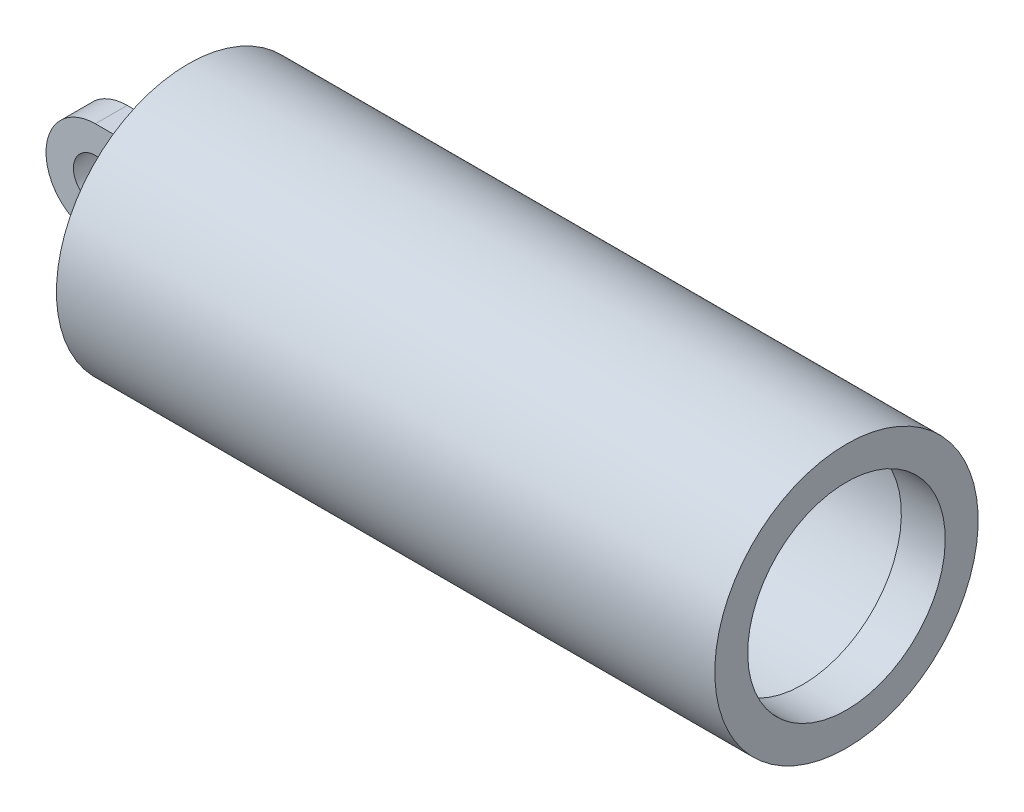
ISO-10303-21;
HEADER;
FILE_DESCRIPTION(('STEP AP214'),'2;1');
FILE_NAME('part.step','',(''),(''),'','','');
FILE_SCHEMA(('AUTOMOTIVE_DESIGN { 1 0 10303 214 1 1 1 1 }'));
ENDSEC;
DATA;
#1=APPLICATION_CONTEXT('core data for automotive mechanical design processes');
#2=APPLICATION_PROTOCOL_DEFINITION('international standard','automotive_design',2000,#1);
#3=PRODUCT_CONTEXT('',#1,'mechanical');
#4=PRODUCT('Part','Part','',(#3));
#5=PRODUCT_RELATED_PRODUCT_CATEGORY('part','',(#4));
#6=PRODUCT_DEFINITION_FORMATION('','',#4);
#7=PRODUCT_DEFINITION_CONTEXT('part definition',#1,'design');
#8=PRODUCT_DEFINITION('design','',#6,#7);
#9=PRODUCT_DEFINITION_SHAPE('','',#8);
#10=(LENGTH_UNIT() NAMED_UNIT(*) SI_UNIT(.MILLI.,.METRE.));
#11=(NAMED_UNIT(*) PLANE_ANGLE_UNIT() SI_UNIT($,.RADIAN.));
#12=(NAMED_UNIT(*) SI_UNIT($,.STERADIAN.) SOLID_ANGLE_UNIT());
#13=UNCERTAINTY_MEASURE_WITH_UNIT(LENGTH_MEASURE(1.E-05),#10,'distance_accuracy_value','');
#14=(GEOMETRIC_REPRESENTATION_CONTEXT(3) GLOBAL_UNCERTAINTY_ASSIGNED_CONTEXT((#13)) GLOBAL_UNIT_ASSIGNED_CONTEXT((#10,
#11,#12)) REPRESENTATION_CONTEXT('',''));
#15=CARTESIAN_POINT('',(0.,0.,0.));
#16=DIRECTION('',(0.,0.,1.));
#17=DIRECTION('',(1.,0.,0.));
#18=AXIS2_PLACEMENT_3D('',#15,#16,#17);
#19=CARTESIAN_POINT('',(-150.,0.,0.));
#20=DIRECTION('',(-1.,0.,0.));
#21=DIRECTION('',(0.,-1.,0.));
#22=AXIS2_PLACEMENT_3D('',#19,#20,#21);
#23=CYLINDRICAL_SURFACE('',#22,55.);
#24=CARTESIAN_POINT('',(130.,0.,0.));
#25=DIRECTION('',(-1.,0.,0.));
#26=DIRECTION('',(0.,-1.,0.));
#27=AXIS2_PLACEMENT_3D('',#24,#25,#26);
#28=CIRCLE('',#27,55.);
#29=CARTESIAN_POINT('',(130.,-55.,0.));
#30=VERTEX_POINT('',#29);
#31=EDGE_CURVE('E115',#30,#30,#28,.T.);
#32=ORIENTED_EDGE('',*,*,#31,.F.);
#33=EDGE_LOOP('',(#32));
#34=FACE_BOUND('',#33,.T.);
#35=CARTESIAN_POINT('',(-130.,0.,0.));
#36=DIRECTION('',(-1.,0.,0.));
#37=DIRECTION('',(0.,-1.,0.));
#38=AXIS2_PLACEMENT_3D('',#35,#36,#37);
#39=CIRCLE('',#38,55.);
#40=CARTESIAN_POINT('',(-130.,-55.,0.));
#41=VERTEX_POINT('',#40);
#42=EDGE_CURVE('E11',#41,#41,#39,.T.);
#43=ORIENTED_EDGE('',*,*,#42,.T.);
#44=EDGE_LOOP('',(#43));
#45=FACE_BOUND('',#44,.T.);
#46=ADVANCED_FACE('F34',(#34,#45),#23,.F.);
#47=CARTESIAN_POINT('',(-130.,0.,0.));
#48=DIRECTION('',(-1.,0.,0.));
#49=DIRECTION('',(0.,-1.,0.));
#50=AXIS2_PLACEMENT_3D('',#47,#48,#49);
#51=PLANE('',#50);
#52=ORIENTED_EDGE('',*,*,#42,.F.);
#53=EDGE_LOOP('',(#52));
#54=FACE_BOUND('',#53,.T.);
#55=ADVANCED_FACE('F160',(#54),#51,.F.);
#56=CARTESIAN_POINT('',(-150.,60.,0.));
#57=DIRECTION('',(1.,0.,0.));
#58=DIRECTION('',(0.,1.,0.));
#59=AXIS2_PLACEMENT_3D('',#56,#57,#58);
#60=PLANE('',#59);
#61=DIRECTION('',(0.,1.,0.));
#62=VECTOR('',#61,1.);
#63=CARTESIAN_POINT('',(-150.,22.5,-7.25));
#64=LINE('',#63,#62);
#65=CARTESIAN_POINT('',(-150.,-22.5,-7.25));
#66=VERTEX_POINT('',#65);
#67=CARTESIAN_POINT('',(-150.,22.5,-7.25));
#68=VERTEX_POINT('',#67);
#69=EDGE_CURVE('E83',#66,#68,#64,.T.);
#70=ORIENTED_EDGE('',*,*,#69,.T.);
#71=DIRECTION('',(0.,0.,1.));
#72=VECTOR('',#71,1.);
#73=CARTESIAN_POINT('',(-150.,22.5,-7.25));
#74=LINE('',#73,#72);
#75=CARTESIAN_POINT('',(-150.,22.5,7.25));
#76=VERTEX_POINT('',#75);
#77=EDGE_CURVE('E113',#68,#76,#74,.T.);
#78=ORIENTED_EDGE('',*,*,#77,.T.);
#79=DIRECTION('',(0.,1.,0.));
#80=VECTOR('',#79,1.);
#81=CARTESIAN_POINT('',(-150.,22.5,7.25));
#82=LINE('',#81,#80);
#83=CARTESIAN_POINT('',(-150.,-22.5,7.25));
#84=VERTEX_POINT('',#83);
#85=EDGE_CURVE('E96',#84,#76,#82,.T.);
#86=ORIENTED_EDGE('',*,*,#85,.F.);
#87=DIRECTION('',(0.,0.,1.));
#88=VECTOR('',#87,1.);
#89=CARTESIAN_POINT('',(-150.,-22.5,-7.25));
#90=LINE('',#89,#88);
#91=EDGE_CURVE('E116',#66,#84,#90,.T.);
#92=ORIENTED_EDGE('',*,*,#91,.F.);
#93=EDGE_LOOP('',(#70,#78,#86,#92));
#94=FACE_BOUND('',#93,.T.);
#95=CARTESIAN_POINT('',(-150.,0.,0.));
#96=DIRECTION('',(-1.,0.,0.));
#97=DIRECTION('',(0.,-1.,0.));
#98=AXIS2_PLACEMENT_3D('',#95,#96,#97);
#99=CIRCLE('',#98,60.);
#100=CARTESIAN_POINT('',(-150.,-60.,0.));
#101=VERTEX_POINT('',#100);
#102=EDGE_CURVE('E41',#101,#101,#99,.T.);
#103=ORIENTED_EDGE('',*,*,#102,.T.);
#104=EDGE_LOOP('',(#103));
#105=FACE_BOUND('',#104,.T.);
#106=ADVANCED_FACE('F132',(#94,#105),#60,.F.);
#107=CARTESIAN_POINT('',(-150.,0.,0.));
#108=DIRECTION('',(-1.,0.,0.));
#109=DIRECTION('',(0.,-1.,0.));
#110=AXIS2_PLACEMENT_3D('',#107,#108,#109);
#111=CYLINDRICAL_SURFACE('',#110,60.);
#112=ORIENTED_EDGE('',*,*,#102,.F.);
#113=EDGE_LOOP('',(#112));
#114=FACE_BOUND('',#113,.T.);
#115=CARTESIAN_POINT('',(150.,0.,0.));
#116=DIRECTION('',(-1.,0.,0.));
#117=DIRECTION('',(0.,-1.,0.));
#118=AXIS2_PLACEMENT_3D('',#115,#116,#117);
#119=CIRCLE('',#118,60.);
#120=CARTESIAN_POINT('',(150.,-60.,0.));
#121=VERTEX_POINT('',#120);
#122=EDGE_CURVE('E127',#121,#121,#119,.T.);
#123=ORIENTED_EDGE('',*,*,#122,.T.);
#124=EDGE_LOOP('',(#123));
#125=FACE_BOUND('',#124,.T.);
#126=ADVANCED_FACE('F134',(#114,#125),#111,.T.);
#127=CARTESIAN_POINT('',(150.,45.,0.));
#128=DIRECTION('',(-1.,0.,0.));
#129=DIRECTION('',(0.,-1.,0.));
#130=AXIS2_PLACEMENT_3D('',#127,#128,#129);
#131=PLANE('',#130);
#132=ORIENTED_EDGE('',*,*,#122,.F.);
#133=EDGE_LOOP('',(#132));
#134=FACE_BOUND('',#133,.T.);
#135=CARTESIAN_POINT('',(150.,0.,0.));
#136=DIRECTION('',(-1.,0.,0.));
#137=DIRECTION('',(0.,-1.,0.));
#138=AXIS2_PLACEMENT_3D('',#135,#136,#137);
#139=CIRCLE('',#138,45.);
#140=CARTESIAN_POINT('',(150.,-45.,0.));
#141=VERTEX_POINT('',#140);
#142=EDGE_CURVE('E124',#141,#141,#139,.T.);
#143=ORIENTED_EDGE('',*,*,#142,.T.);
#144=EDGE_LOOP('',(#143));
#145=FACE_BOUND('',#144,.T.);
#146=ADVANCED_FACE('F137',(#134,#145),#131,.F.);
#147=CARTESIAN_POINT('',(-150.,0.,0.));
#148=DIRECTION('',(-1.,0.,0.));
#149=DIRECTION('',(0.,-1.,0.));
#150=AXIS2_PLACEMENT_3D('',#147,#148,#149);
#151=CYLINDRICAL_SURFACE('',#150,45.);
#152=ORIENTED_EDGE('',*,*,#142,.F.);
#153=EDGE_LOOP('',(#152));
#154=FACE_BOUND('',#153,.T.);
#155=CARTESIAN_POINT('',(130.,0.,0.));
#156=DIRECTION('',(-1.,0.,0.));
#157=DIRECTION('',(0.,-1.,0.));
#158=AXIS2_PLACEMENT_3D('',#155,#156,#157);
#159=CIRCLE('',#158,45.);
#160=CARTESIAN_POINT('',(130.,-45.,0.));
#161=VERTEX_POINT('',#160);
#162=EDGE_CURVE('E121',#161,#161,#159,.T.);
#163=ORIENTED_EDGE('',*,*,#162,.T.);
#164=EDGE_LOOP('',(#163));
#165=FACE_BOUND('',#164,.T.);
#166=ADVANCED_FACE('F143',(#154,#165),#151,.F.);
#167=CARTESIAN_POINT('',(130.,55.,0.));
#168=DIRECTION('',(1.,0.,0.));
#169=DIRECTION('',(0.,1.,0.));
#170=AXIS2_PLACEMENT_3D('',#167,#168,#169);
#171=PLANE('',#170);
#172=ORIENTED_EDGE('',*,*,#162,.F.);
#173=EDGE_LOOP('',(#172));
#174=FACE_BOUND('',#173,.T.);
#175=ORIENTED_EDGE('',*,*,#31,.T.);
#176=EDGE_LOOP('',(#175));
#177=FACE_BOUND('',#176,.T.);
#178=ADVANCED_FACE('F149',(#174,#177),#171,.F.);
#179=CARTESIAN_POINT('',(-150.,22.5,-7.25));
#180=DIRECTION('',(0.,1.,0.));
#181=DIRECTION('',(-1.,0.,0.));
#182=AXIS2_PLACEMENT_3D('',#179,#180,#181);
#183=PLANE('',#182);
#184=DIRECTION('',(0.,0.,1.));
#185=VECTOR('',#184,1.);
#186=CARTESIAN_POINT('',(-185.,22.5,-7.25));
#187=LINE('',#186,#185);
#188=CARTESIAN_POINT('',(-185.,22.5,-7.25));
#189=VERTEX_POINT('',#188);
#190=CARTESIAN_POINT('',(-185.,22.5,7.25));
#191=VERTEX_POINT('',#190);
#192=EDGE_CURVE('E74',#189,#191,#187,.T.);
#193=ORIENTED_EDGE('',*,*,#192,.T.);
#194=DIRECTION('',(-1.,0.,0.));
#195=VECTOR('',#194,1.);
#196=CARTESIAN_POINT('',(-150.,22.5,7.25));
#197=LINE('',#196,#195);
#198=EDGE_CURVE('E78',#76,#191,#197,.T.);
#199=ORIENTED_EDGE('',*,*,#198,.F.);
#200=ORIENTED_EDGE('',*,*,#77,.F.);
#201=DIRECTION('',(-1.,0.,0.));
#202=VECTOR('',#201,1.);
#203=CARTESIAN_POINT('',(-150.,22.5,-7.25));
#204=LINE('',#203,#202);
#205=EDGE_CURVE('E48',#68,#189,#204,.T.);
#206=ORIENTED_EDGE('',*,*,#205,.T.);
#207=EDGE_LOOP('',(#193,#199,#200,#206));
#208=FACE_BOUND('',#207,.T.);
#209=ADVANCED_FACE('F76',(#208),#183,.T.);
#210=CARTESIAN_POINT('',(-150.,-22.5,-7.25));
#211=DIRECTION('',(0.,-1.,0.));
#212=DIRECTION('',(1.,0.,0.));
#213=AXIS2_PLACEMENT_3D('',#210,#211,#212);
#214=PLANE('',#213);
#215=ORIENTED_EDGE('',*,*,#91,.T.);
#216=DIRECTION('',(1.,0.,0.));
#217=VECTOR('',#216,1.);
#218=CARTESIAN_POINT('',(-150.,-22.5,7.25));
#219=LINE('',#218,#217);
#220=CARTESIAN_POINT('',(-185.,-22.5,7.25));
#221=VERTEX_POINT('',#220);
#222=EDGE_CURVE('E91',#221,#84,#219,.T.);
#223=ORIENTED_EDGE('',*,*,#222,.F.);
#224=DIRECTION('',(0.,0.,1.));
#225=VECTOR('',#224,1.);
#226=CARTESIAN_POINT('',(-185.,-22.5,-7.25));
#227=LINE('',#226,#225);
#228=CARTESIAN_POINT('',(-185.,-22.5,-7.25));
#229=VERTEX_POINT('',#228);
#230=EDGE_CURVE('E82',#229,#221,#227,.T.);
#231=ORIENTED_EDGE('',*,*,#230,.F.);
#232=DIRECTION('',(1.,0.,0.));
#233=VECTOR('',#232,1.);
#234=CARTESIAN_POINT('',(-150.,-22.5,-7.25));
#235=LINE('',#234,#233);
#236=EDGE_CURVE('E56',#229,#66,#235,.T.);
#237=ORIENTED_EDGE('',*,*,#236,.T.);
#238=EDGE_LOOP('',(#215,#223,#231,#237));
#239=FACE_BOUND('',#238,.T.);
#240=ADVANCED_FACE('F172',(#239),#214,.T.);
#241=CARTESIAN_POINT('',(-185.,0.,-7.25));
#242=DIRECTION('',(0.,0.,1.));
#243=DIRECTION('',(1.,0.,0.));
#244=AXIS2_PLACEMENT_3D('',#241,#242,#243);
#245=CYLINDRICAL_SURFACE('',#244,22.5);
#246=ORIENTED_EDGE('',*,*,#230,.T.);
#247=CARTESIAN_POINT('',(-185.,0.,7.25));
#248=DIRECTION('',(0.,0.,1.));
#249=DIRECTION('',(1.,0.,0.));
#250=AXIS2_PLACEMENT_3D('',#247,#248,#249);
#251=CIRCLE('',#250,22.5);
#252=EDGE_CURVE('E86',#191,#221,#251,.T.);
#253=ORIENTED_EDGE('',*,*,#252,.F.);
#254=ORIENTED_EDGE('',*,*,#192,.F.);
#255=CARTESIAN_POINT('',(-185.,0.,-7.25));
#256=DIRECTION('',(0.,0.,1.));
#257=DIRECTION('',(1.,0.,0.));
#258=AXIS2_PLACEMENT_3D('',#255,#256,#257);
#259=CIRCLE('',#258,22.5);
#260=EDGE_CURVE('E108',#189,#229,#259,.T.);
#261=ORIENTED_EDGE('',*,*,#260,.T.);
#262=EDGE_LOOP('',(#246,#253,#254,#261));
#263=FACE_BOUND('',#262,.T.);
#264=ADVANCED_FACE('F87',(#263),#245,.T.);
#265=CARTESIAN_POINT('',(-185.,0.,-7.25));
#266=DIRECTION('',(0.,0.,1.));
#267=DIRECTION('',(1.,0.,0.));
#268=AXIS2_PLACEMENT_3D('',#265,#266,#267);
#269=PLANE('',#268);
#270=CARTESIAN_POINT('',(-185.,0.,-7.25));
#271=DIRECTION('',(0.,0.,1.));
#272=DIRECTION('',(1.,0.,0.));
#273=AXIS2_PLACEMENT_3D('',#270,#271,#272);
#274=CIRCLE('',#273,10.);
#275=CARTESIAN_POINT('',(-175.,0.,-7.25));
#276=VERTEX_POINT('',#275);
#277=EDGE_CURVE('E104',#276,#276,#274,.T.);
#278=ORIENTED_EDGE('',*,*,#277,.T.);
#279=EDGE_LOOP('',(#278));
#280=FACE_BOUND('',#279,.T.);
#281=ORIENTED_EDGE('',*,*,#205,.F.);
#282=ORIENTED_EDGE('',*,*,#69,.F.);
#283=ORIENTED_EDGE('',*,*,#236,.F.);
#284=ORIENTED_EDGE('',*,*,#260,.F.);
#285=EDGE_LOOP('',(#281,#282,#283,#284));
#286=FACE_BOUND('',#285,.T.);
#287=ADVANCED_FACE('F175',(#280,#286),#269,.F.);
#288=CARTESIAN_POINT('',(-185.,0.,-7.25));
#289=DIRECTION('',(0.,0.,1.));
#290=DIRECTION('',(1.,0.,0.));
#291=AXIS2_PLACEMENT_3D('',#288,#289,#290);
#292=CYLINDRICAL_SURFACE('',#291,10.);
#293=ORIENTED_EDGE('',*,*,#277,.F.);
#294=EDGE_LOOP('',(#293));
#295=FACE_BOUND('',#294,.T.);
#296=CARTESIAN_POINT('',(-185.,0.,7.25));
#297=DIRECTION('',(0.,0.,1.));
#298=DIRECTION('',(1.,0.,0.));
#299=AXIS2_PLACEMENT_3D('',#296,#297,#298);
#300=CIRCLE('',#299,10.);
#301=CARTESIAN_POINT('',(-175.,0.,7.25));
#302=VERTEX_POINT('',#301);
#303=EDGE_CURVE('E97',#302,#302,#300,.T.);
#304=ORIENTED_EDGE('',*,*,#303,.T.);
#305=EDGE_LOOP('',(#304));
#306=FACE_BOUND('',#305,.T.);
#307=ADVANCED_FACE('F180',(#295,#306),#292,.F.);
#308=CARTESIAN_POINT('',(-185.,0.,7.25));
#309=DIRECTION('',(0.,0.,1.));
#310=DIRECTION('',(1.,0.,0.));
#311=AXIS2_PLACEMENT_3D('',#308,#309,#310);
#312=PLANE('',#311);
#313=ORIENTED_EDGE('',*,*,#198,.T.);
#314=ORIENTED_EDGE('',*,*,#252,.T.);
#315=ORIENTED_EDGE('',*,*,#222,.T.);
#316=ORIENTED_EDGE('',*,*,#85,.T.);
#317=EDGE_LOOP('',(#313,#314,#315,#316));
#318=FACE_BOUND('',#317,.T.);
#319=ORIENTED_EDGE('',*,*,#303,.F.);
#320=EDGE_LOOP('',(#319));
#321=FACE_BOUND('',#320,.T.);
#322=ADVANCED_FACE('F93',(#318,#321),#312,.T.);
#323=CLOSED_SHELL('',(#46,#55,#106,#126,#146,#166,#178,#209,#240,#264,#287,#307,#322));
#324=MANIFOLD_SOLID_BREP('B2',#323);
#325=ADVANCED_BREP_SHAPE_REPRESENTATION('',(#18,#324),#14);
#326=SHAPE_DEFINITION_REPRESENTATION(#9,#325);
ENDSEC;
END-ISO-10303-21;
